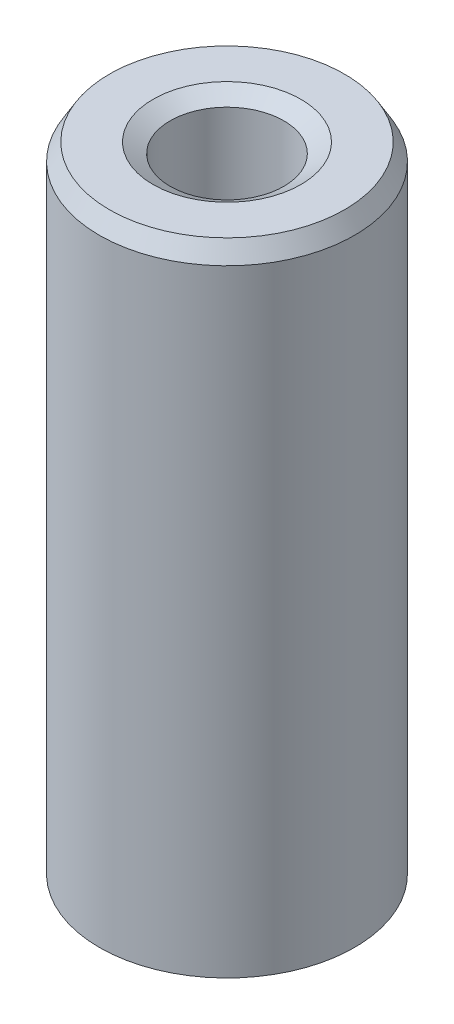
ISO-10303-21;
HEADER;
FILE_DESCRIPTION(('STEP AP214'),'2;1');
FILE_NAME('part.step','',(''),(''),'','','');
FILE_SCHEMA(('AUTOMOTIVE_DESIGN { 1 0 10303 214 1 1 1 1 }'));
ENDSEC;
DATA;
#1=APPLICATION_CONTEXT('core data for automotive mechanical design processes');
#2=APPLICATION_PROTOCOL_DEFINITION('international standard','automotive_design',2000,#1);
#3=PRODUCT_CONTEXT('',#1,'mechanical');
#4=PRODUCT('Part','Part','',(#3));
#5=PRODUCT_RELATED_PRODUCT_CATEGORY('part','',(#4));
#6=PRODUCT_DEFINITION_FORMATION('','',#4);
#7=PRODUCT_DEFINITION_CONTEXT('part definition',#1,'design');
#8=PRODUCT_DEFINITION('design','',#6,#7);
#9=PRODUCT_DEFINITION_SHAPE('','',#8);
#10=(LENGTH_UNIT() NAMED_UNIT(*) SI_UNIT(.MILLI.,.METRE.));
#11=(NAMED_UNIT(*) PLANE_ANGLE_UNIT() SI_UNIT($,.RADIAN.));
#12=(NAMED_UNIT(*) SI_UNIT($,.STERADIAN.) SOLID_ANGLE_UNIT());
#13=UNCERTAINTY_MEASURE_WITH_UNIT(LENGTH_MEASURE(1.E-05),#10,'distance_accuracy_value','');
#14=(GEOMETRIC_REPRESENTATION_CONTEXT(3) GLOBAL_UNCERTAINTY_ASSIGNED_CONTEXT((#13)) GLOBAL_UNIT_ASSIGNED_CONTEXT((#10,
#11,#12)) REPRESENTATION_CONTEXT('',''));
#15=CARTESIAN_POINT('',(0.,0.,0.));
#16=DIRECTION('',(0.,0.,1.));
#17=DIRECTION('',(1.,0.,0.));
#18=AXIS2_PLACEMENT_3D('',#15,#16,#17);
#19=CARTESIAN_POINT('',(0.,37.8421154285752,0.));
#20=DIRECTION('',(0.,-1.,0.));
#21=DIRECTION('',(0.,0.,-1.));
#22=AXIS2_PLACEMENT_3D('',#19,#20,#21);
#23=CYLINDRICAL_SURFACE('',#22,7.5);
#24=CARTESIAN_POINT('',(0.,0.592250996651764,0.));
#25=DIRECTION('',(0.,1.,0.));
#26=DIRECTION('',(0.,0.,1.));
#27=AXIS2_PLACEMENT_3D('',#24,#25,#26);
#28=CIRCLE('',#27,7.5);
#29=CARTESIAN_POINT('',(0.,0.592250996651764,7.5));
#30=VERTEX_POINT('',#29);
#31=EDGE_CURVE('E10',#30,#30,#28,.T.);
#32=ORIENTED_EDGE('',*,*,#31,.T.);
#33=EDGE_LOOP('',(#32));
#34=FACE_BOUND('',#33,.T.);
#35=CARTESIAN_POINT('',(0.,36.8388032678242,0.));
#36=DIRECTION('',(0.,1.,0.));
#37=DIRECTION('',(0.,0.,1.));
#38=AXIS2_PLACEMENT_3D('',#35,#36,#37);
#39=CIRCLE('',#38,7.5);
#40=CARTESIAN_POINT('',(0.,36.8388032678242,7.5));
#41=VERTEX_POINT('',#40);
#42=EDGE_CURVE('E50',#41,#41,#39,.F.);
#43=ORIENTED_EDGE('',*,*,#42,.T.);
#44=EDGE_LOOP('',(#43));
#45=FACE_BOUND('',#44,.T.);
#46=ADVANCED_FACE('F39',(#34,#45),#23,.T.);
#47=CARTESIAN_POINT('',(0.,37.8421154285752,0.));
#48=DIRECTION('',(0.,1.,0.));
#49=DIRECTION('',(0.,0.,1.));
#50=AXIS2_PLACEMENT_3D('',#47,#48,#49);
#51=PLANE('',#50);
#52=CARTESIAN_POINT('',(0.,37.8421154285752,0.));
#53=DIRECTION('',(0.,1.,0.));
#54=DIRECTION('',(0.,0.,1.));
#55=AXIS2_PLACEMENT_3D('',#52,#53,#54);
#56=CIRCLE('',#55,4.34381865202987);
#57=CARTESIAN_POINT('',(0.,37.8421154285752,4.34381865202987));
#58=VERTEX_POINT('',#57);
#59=EDGE_CURVE('E58',#58,#58,#56,.F.);
#60=ORIENTED_EDGE('',*,*,#59,.T.);
#61=EDGE_LOOP('',(#60));
#62=FACE_BOUND('',#61,.T.);
#63=CARTESIAN_POINT('',(0.,37.8421154285752,0.));
#64=DIRECTION('',(0.,1.,0.));
#65=DIRECTION('',(0.,0.,1.));
#66=AXIS2_PLACEMENT_3D('',#63,#64,#65);
#67=CIRCLE('',#66,6.90774900334823);
#68=CARTESIAN_POINT('',(0.,37.8421154285752,6.90774900334823));
#69=VERTEX_POINT('',#68);
#70=EDGE_CURVE('E61',#69,#69,#67,.T.);
#71=ORIENTED_EDGE('',*,*,#70,.T.);
#72=EDGE_LOOP('',(#71));
#73=FACE_BOUND('',#72,.T.);
#74=ADVANCED_FACE('F88',(#62,#73),#51,.T.);
#75=CARTESIAN_POINT('',(0.,0.,0.));
#76=DIRECTION('',(0.,1.,0.));
#77=DIRECTION('',(0.,0.,1.));
#78=AXIS2_PLACEMENT_3D('',#75,#76,#77);
#79=PLANE('',#78);
#80=CARTESIAN_POINT('',(0.,0.,0.));
#81=DIRECTION('',(0.,1.,0.));
#82=DIRECTION('',(0.,0.,1.));
#83=AXIS2_PLACEMENT_3D('',#80,#81,#82);
#84=CIRCLE('',#83,3.9327574879306);
#85=CARTESIAN_POINT('',(0.,0.,3.9327574879306));
#86=VERTEX_POINT('',#85);
#87=EDGE_CURVE('E51',#86,#86,#84,.T.);
#88=ORIENTED_EDGE('',*,*,#87,.T.);
#89=EDGE_LOOP('',(#88));
#90=FACE_BOUND('',#89,.T.);
#91=CARTESIAN_POINT('',(0.,0.,0.));
#92=DIRECTION('',(0.,1.,0.));
#93=DIRECTION('',(0.,0.,1.));
#94=AXIS2_PLACEMENT_3D('',#91,#92,#93);
#95=CIRCLE('',#94,6.49668783924897);
#96=CARTESIAN_POINT('',(0.,0.,6.49668783924897));
#97=VERTEX_POINT('',#96);
#98=EDGE_CURVE('E54',#97,#97,#95,.F.);
#99=ORIENTED_EDGE('',*,*,#98,.T.);
#100=EDGE_LOOP('',(#99));
#101=FACE_BOUND('',#100,.T.);
#102=ADVANCED_FACE('F83',(#90,#101),#79,.F.);
#103=CARTESIAN_POINT('',(0.,37.8421154285752,0.));
#104=DIRECTION('',(0.,-1.,0.));
#105=DIRECTION('',(0.,0.,-1.));
#106=AXIS2_PLACEMENT_3D('',#103,#104,#105);
#107=CYLINDRICAL_SURFACE('',#106,3.34050649127884);
#108=CARTESIAN_POINT('',(0.,37.2498644319235,0.));
#109=DIRECTION('',(0.,1.,0.));
#110=DIRECTION('',(0.,0.,1.));
#111=AXIS2_PLACEMENT_3D('',#108,#109,#110);
#112=CIRCLE('',#111,3.34050649127884);
#113=CARTESIAN_POINT('',(0.,37.2498644319235,3.34050649127884));
#114=VERTEX_POINT('',#113);
#115=EDGE_CURVE('E67',#114,#114,#112,.T.);
#116=ORIENTED_EDGE('',*,*,#115,.T.);
#117=EDGE_LOOP('',(#116));
#118=FACE_BOUND('',#117,.T.);
#119=CARTESIAN_POINT('',(0.,1.00331216075104,0.));
#120=DIRECTION('',(0.,1.,0.));
#121=DIRECTION('',(0.,0.,1.));
#122=AXIS2_PLACEMENT_3D('',#119,#120,#121);
#123=CIRCLE('',#122,3.34050649127884);
#124=CARTESIAN_POINT('',(0.,1.00331216075104,3.34050649127884));
#125=VERTEX_POINT('',#124);
#126=EDGE_CURVE('E69',#125,#125,#123,.F.);
#127=ORIENTED_EDGE('',*,*,#126,.T.);
#128=EDGE_LOOP('',(#127));
#129=FACE_BOUND('',#128,.T.);
#130=ADVANCED_FACE('F71',(#118,#129),#107,.F.);
#131=CARTESIAN_POINT('',(0.,37.2498644319235,0.));
#132=DIRECTION('',(0.,1.,0.));
#133=DIRECTION('',(0.,0.,1.));
#134=AXIS2_PLACEMENT_3D('',#131,#132,#133);
#135=CONICAL_SURFACE('',#134,3.34050649127884,1.0375427940016);
#136=ORIENTED_EDGE('',*,*,#59,.F.);
#137=EDGE_LOOP('',(#136));
#138=FACE_BOUND('',#137,.T.);
#139=ORIENTED_EDGE('',*,*,#115,.F.);
#140=EDGE_LOOP('',(#139));
#141=FACE_BOUND('',#140,.T.);
#142=ADVANCED_FACE('F77',(#138,#141),#135,.F.);
#143=CARTESIAN_POINT('',(0.,0.,0.));
#144=DIRECTION('',(0.,-1.,0.));
#145=DIRECTION('',(0.,0.,-1.));
#146=AXIS2_PLACEMENT_3D('',#143,#144,#145);
#147=CONICAL_SURFACE('',#146,3.9327574879306,0.533253532793295);
#148=ORIENTED_EDGE('',*,*,#126,.F.);
#149=EDGE_LOOP('',(#148));
#150=FACE_BOUND('',#149,.T.);
#151=ORIENTED_EDGE('',*,*,#87,.F.);
#152=EDGE_LOOP('',(#151));
#153=FACE_BOUND('',#152,.T.);
#154=ADVANCED_FACE('F73',(#150,#153),#147,.F.);
#155=CARTESIAN_POINT('',(0.,0.592250996651764,0.));
#156=DIRECTION('',(0.,1.,0.));
#157=DIRECTION('',(0.,0.,1.));
#158=AXIS2_PLACEMENT_3D('',#155,#156,#157);
#159=CONICAL_SURFACE('',#158,7.5,1.0375427940016);
#160=ORIENTED_EDGE('',*,*,#98,.F.);
#161=EDGE_LOOP('',(#160));
#162=FACE_BOUND('',#161,.T.);
#163=ORIENTED_EDGE('',*,*,#31,.F.);
#164=EDGE_LOOP('',(#163));
#165=FACE_BOUND('',#164,.T.);
#166=ADVANCED_FACE('F76',(#162,#165),#159,.T.);
#167=CARTESIAN_POINT('',(0.,37.8421154285752,0.));
#168=DIRECTION('',(0.,-1.,0.));
#169=DIRECTION('',(0.,0.,-1.));
#170=AXIS2_PLACEMENT_3D('',#167,#168,#169);
#171=CONICAL_SURFACE('',#170,6.90774900334823,0.533253532793296);
#172=ORIENTED_EDGE('',*,*,#42,.F.);
#173=EDGE_LOOP('',(#172));
#174=FACE_BOUND('',#173,.T.);
#175=ORIENTED_EDGE('',*,*,#70,.F.);
#176=EDGE_LOOP('',(#175));
#177=FACE_BOUND('',#176,.T.);
#178=ADVANCED_FACE('F45',(#174,#177),#171,.T.);
#179=CLOSED_SHELL('',(#46,#74,#102,#130,#142,#154,#166,#178));
#180=MANIFOLD_SOLID_BREP('B2',#179);
#181=ADVANCED_BREP_SHAPE_REPRESENTATION('',(#18,#180),#14);
#182=SHAPE_DEFINITION_REPRESENTATION(#9,#181);
ENDSEC;
END-ISO-10303-21;
